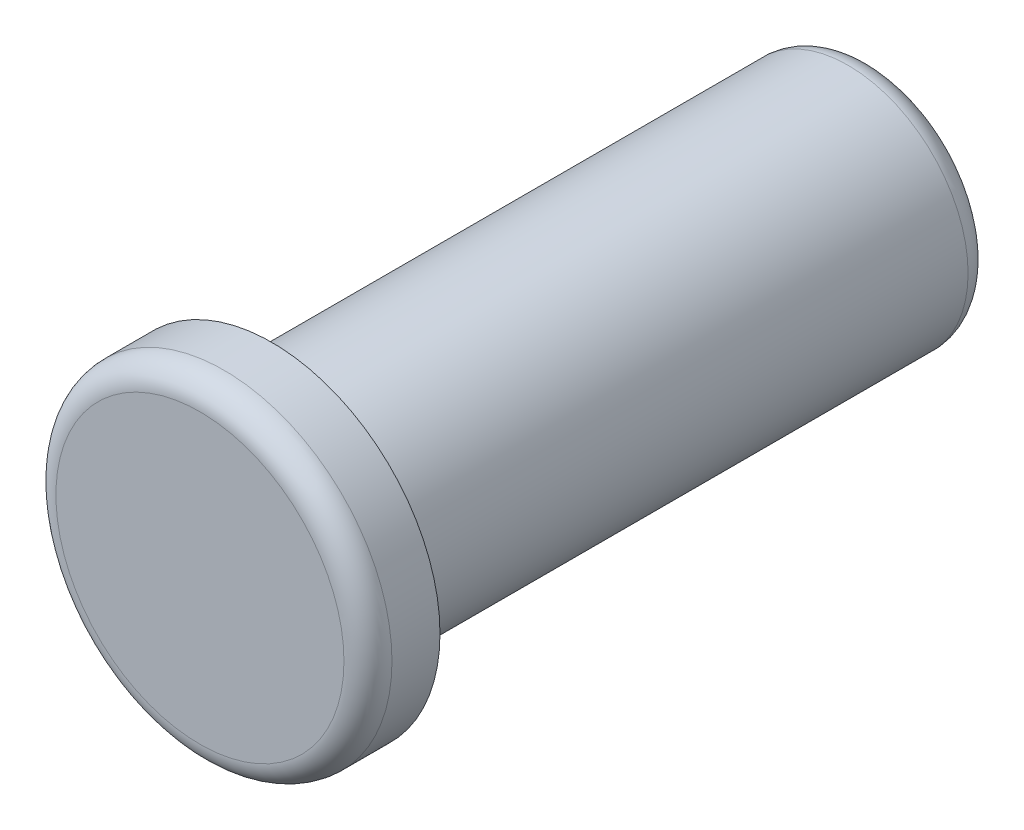
ISO-10303-21;
HEADER;
FILE_DESCRIPTION(('STEP AP214'),'2;1');
FILE_NAME('part.step','',(''),(''),'','','');
FILE_SCHEMA(('AUTOMOTIVE_DESIGN { 1 0 10303 214 1 1 1 1 }'));
ENDSEC;
DATA;
#1=APPLICATION_CONTEXT('core data for automotive mechanical design processes');
#2=APPLICATION_PROTOCOL_DEFINITION('international standard','automotive_design',2000,#1);
#3=PRODUCT_CONTEXT('',#1,'mechanical');
#4=PRODUCT('Part','Part','',(#3));
#5=PRODUCT_RELATED_PRODUCT_CATEGORY('part','',(#4));
#6=PRODUCT_DEFINITION_FORMATION('','',#4);
#7=PRODUCT_DEFINITION_CONTEXT('part definition',#1,'design');
#8=PRODUCT_DEFINITION('design','',#6,#7);
#9=PRODUCT_DEFINITION_SHAPE('','',#8);
#10=(LENGTH_UNIT() NAMED_UNIT(*) SI_UNIT(.MILLI.,.METRE.));
#11=(NAMED_UNIT(*) PLANE_ANGLE_UNIT() SI_UNIT($,.RADIAN.));
#12=(NAMED_UNIT(*) SI_UNIT($,.STERADIAN.) SOLID_ANGLE_UNIT());
#13=UNCERTAINTY_MEASURE_WITH_UNIT(LENGTH_MEASURE(1.E-05),#10,'distance_accuracy_value','');
#14=(GEOMETRIC_REPRESENTATION_CONTEXT(3) GLOBAL_UNCERTAINTY_ASSIGNED_CONTEXT((#13)) GLOBAL_UNIT_ASSIGNED_CONTEXT((#10,
#11,#12)) REPRESENTATION_CONTEXT('',''));
#15=CARTESIAN_POINT('',(0.,0.,0.));
#16=DIRECTION('',(0.,0.,1.));
#17=DIRECTION('',(1.,0.,0.));
#18=AXIS2_PLACEMENT_3D('',#15,#16,#17);
#19=CARTESIAN_POINT('',(0.,0.,3.));
#20=DIRECTION('',(0.,0.,-1.));
#21=DIRECTION('',(-1.,0.,0.));
#22=AXIS2_PLACEMENT_3D('',#19,#20,#21);
#23=CYLINDRICAL_SURFACE('',#22,7.);
#24=CARTESIAN_POINT('',(0.,0.,2.));
#25=DIRECTION('',(0.,0.,1.));
#26=DIRECTION('',(1.,0.,0.));
#27=AXIS2_PLACEMENT_3D('',#24,#25,#26);
#28=CIRCLE('',#27,7.);
#29=CARTESIAN_POINT('',(7.,0.,2.));
#30=VERTEX_POINT('',#29);
#31=EDGE_CURVE('E10',#30,#30,#28,.F.);
#32=ORIENTED_EDGE('',*,*,#31,.T.);
#33=EDGE_LOOP('',(#32));
#34=FACE_BOUND('',#33,.T.);
#35=CARTESIAN_POINT('',(0.,0.,0.));
#36=DIRECTION('',(0.,0.,1.));
#37=DIRECTION('',(1.,0.,0.));
#38=AXIS2_PLACEMENT_3D('',#35,#36,#37);
#39=CIRCLE('',#38,7.);
#40=CARTESIAN_POINT('',(7.,0.,0.));
#41=VERTEX_POINT('',#40);
#42=EDGE_CURVE('E54',#41,#41,#39,.T.);
#43=ORIENTED_EDGE('',*,*,#42,.T.);
#44=EDGE_LOOP('',(#43));
#45=FACE_BOUND('',#44,.T.);
#46=ADVANCED_FACE('F33',(#34,#45),#23,.T.);
#47=CARTESIAN_POINT('',(0.,0.,3.));
#48=DIRECTION('',(0.,0.,1.));
#49=DIRECTION('',(1.,0.,0.));
#50=AXIS2_PLACEMENT_3D('',#47,#48,#49);
#51=PLANE('',#50);
#52=CARTESIAN_POINT('',(0.,0.,3.));
#53=DIRECTION('',(0.,0.,1.));
#54=DIRECTION('',(1.,0.,0.));
#55=AXIS2_PLACEMENT_3D('',#52,#53,#54);
#56=CIRCLE('',#55,6.);
#57=CARTESIAN_POINT('',(6.,0.,3.));
#58=VERTEX_POINT('',#57);
#59=EDGE_CURVE('E40',#58,#58,#56,.T.);
#60=ORIENTED_EDGE('',*,*,#59,.T.);
#61=EDGE_LOOP('',(#60));
#62=FACE_BOUND('',#61,.T.);
#63=ADVANCED_FACE('F65',(#62),#51,.T.);
#64=CARTESIAN_POINT('',(0.,0.,0.));
#65=DIRECTION('',(0.,0.,1.));
#66=DIRECTION('',(1.,0.,0.));
#67=AXIS2_PLACEMENT_3D('',#64,#65,#66);
#68=PLANE('',#67);
#69=CARTESIAN_POINT('',(0.,0.,0.));
#70=DIRECTION('',(0.,0.,-1.));
#71=DIRECTION('',(-1.,0.,0.));
#72=AXIS2_PLACEMENT_3D('',#69,#70,#71);
#73=CIRCLE('',#72,5.);
#74=CARTESIAN_POINT('',(-5.,0.,0.));
#75=VERTEX_POINT('',#74);
#76=EDGE_CURVE('E53',#75,#75,#73,.T.);
#77=ORIENTED_EDGE('',*,*,#76,.F.);
#78=EDGE_LOOP('',(#77));
#79=FACE_BOUND('',#78,.T.);
#80=ORIENTED_EDGE('',*,*,#42,.F.);
#81=EDGE_LOOP('',(#80));
#82=FACE_BOUND('',#81,.T.);
#83=ADVANCED_FACE('F62',(#79,#82),#68,.F.);
#84=CARTESIAN_POINT('',(0.,0.,-25.));
#85=DIRECTION('',(0.,0.,1.));
#86=DIRECTION('',(1.,0.,0.));
#87=AXIS2_PLACEMENT_3D('',#84,#85,#86);
#88=CYLINDRICAL_SURFACE('',#87,5.);
#89=CARTESIAN_POINT('',(0.,0.,-24.));
#90=DIRECTION('',(0.,0.,-1.));
#91=DIRECTION('',(-1.,0.,0.));
#92=AXIS2_PLACEMENT_3D('',#89,#90,#91);
#93=CIRCLE('',#92,5.);
#94=CARTESIAN_POINT('',(-5.,0.,-24.));
#95=VERTEX_POINT('',#94);
#96=EDGE_CURVE('E44',#95,#95,#93,.F.);
#97=ORIENTED_EDGE('',*,*,#96,.T.);
#98=EDGE_LOOP('',(#97));
#99=FACE_BOUND('',#98,.T.);
#100=ORIENTED_EDGE('',*,*,#76,.T.);
#101=EDGE_LOOP('',(#100));
#102=FACE_BOUND('',#101,.T.);
#103=ADVANCED_FACE('F60',(#99,#102),#88,.T.);
#104=CARTESIAN_POINT('',(0.,0.,-25.));
#105=DIRECTION('',(0.,0.,-1.));
#106=DIRECTION('',(-1.,0.,0.));
#107=AXIS2_PLACEMENT_3D('',#104,#105,#106);
#108=PLANE('',#107);
#109=CARTESIAN_POINT('',(0.,0.,-25.));
#110=DIRECTION('',(0.,0.,-1.));
#111=DIRECTION('',(-1.,0.,0.));
#112=AXIS2_PLACEMENT_3D('',#109,#110,#111);
#113=CIRCLE('',#112,4.);
#114=CARTESIAN_POINT('',(-4.,0.,-25.));
#115=VERTEX_POINT('',#114);
#116=EDGE_CURVE('E48',#115,#115,#113,.T.);
#117=ORIENTED_EDGE('',*,*,#116,.T.);
#118=EDGE_LOOP('',(#117));
#119=FACE_BOUND('',#118,.T.);
#120=ADVANCED_FACE('F77',(#119),#108,.T.);
#121=CARTESIAN_POINT('',(0.,0.,-24.));
#122=DIRECTION('',(0.,0.,-1.));
#123=DIRECTION('',(-1.,0.,0.));
#124=AXIS2_PLACEMENT_3D('',#121,#122,#123);
#125=TOROIDAL_SURFACE('',#124,4.,1.);
#126=ORIENTED_EDGE('',*,*,#96,.F.);
#127=EDGE_LOOP('',(#126));
#128=FACE_BOUND('',#127,.T.);
#129=ORIENTED_EDGE('',*,*,#116,.F.);
#130=EDGE_LOOP('',(#129));
#131=FACE_BOUND('',#130,.T.);
#132=ADVANCED_FACE('F75',(#128,#131),#125,.T.);
#133=CARTESIAN_POINT('',(0.,0.,2.));
#134=DIRECTION('',(0.,0.,1.));
#135=DIRECTION('',(1.,0.,0.));
#136=AXIS2_PLACEMENT_3D('',#133,#134,#135);
#137=TOROIDAL_SURFACE('',#136,6.,1.);
#138=ORIENTED_EDGE('',*,*,#31,.F.);
#139=EDGE_LOOP('',(#138));
#140=FACE_BOUND('',#139,.T.);
#141=ORIENTED_EDGE('',*,*,#59,.F.);
#142=EDGE_LOOP('',(#141));
#143=FACE_BOUND('',#142,.T.);
#144=ADVANCED_FACE('F35',(#140,#143),#137,.T.);
#145=CLOSED_SHELL('',(#46,#63,#83,#103,#120,#132,#144));
#146=MANIFOLD_SOLID_BREP('B2',#145);
#147=ADVANCED_BREP_SHAPE_REPRESENTATION('',(#18,#146),#14);
#148=SHAPE_DEFINITION_REPRESENTATION(#9,#147);
ENDSEC;
END-ISO-10303-21;
